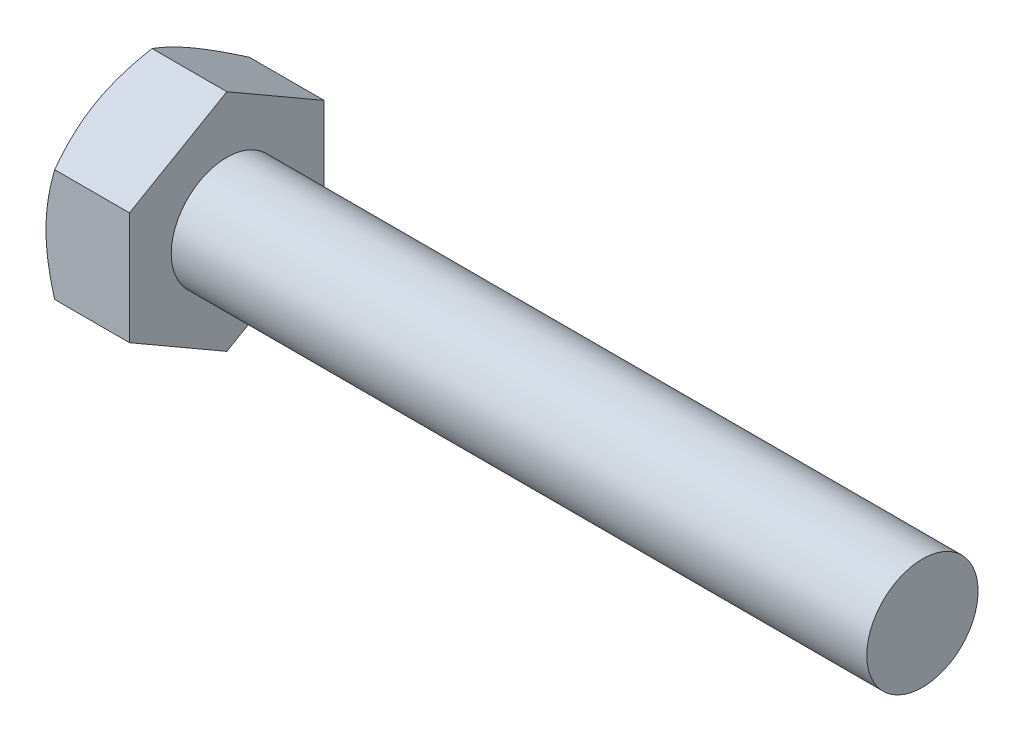
ISO-10303-21;
HEADER;
FILE_DESCRIPTION(('STEP AP214'),'2;1');
FILE_NAME('part.step','',(''),(''),'','','');
FILE_SCHEMA(('AUTOMOTIVE_DESIGN { 1 0 10303 214 1 1 1 1 }'));
ENDSEC;
DATA;
#1=APPLICATION_CONTEXT('core data for automotive mechanical design processes');
#2=APPLICATION_PROTOCOL_DEFINITION('international standard','automotive_design',2000,#1);
#3=PRODUCT_CONTEXT('',#1,'mechanical');
#4=PRODUCT('Part','Part','',(#3));
#5=PRODUCT_RELATED_PRODUCT_CATEGORY('part','',(#4));
#6=PRODUCT_DEFINITION_FORMATION('','',#4);
#7=PRODUCT_DEFINITION_CONTEXT('part definition',#1,'design');
#8=PRODUCT_DEFINITION('design','',#6,#7);
#9=PRODUCT_DEFINITION_SHAPE('','',#8);
#10=(LENGTH_UNIT() NAMED_UNIT(*) SI_UNIT(.MILLI.,.METRE.));
#11=(NAMED_UNIT(*) PLANE_ANGLE_UNIT() SI_UNIT($,.RADIAN.));
#12=(NAMED_UNIT(*) SI_UNIT($,.STERADIAN.) SOLID_ANGLE_UNIT());
#13=UNCERTAINTY_MEASURE_WITH_UNIT(LENGTH_MEASURE(1.E-05),#10,'distance_accuracy_value','');
#14=(GEOMETRIC_REPRESENTATION_CONTEXT(3) GLOBAL_UNCERTAINTY_ASSIGNED_CONTEXT((#13)) GLOBAL_UNIT_ASSIGNED_CONTEXT((#10,
#11,#12)) REPRESENTATION_CONTEXT('',''));
#15=CARTESIAN_POINT('',(0.,0.,0.));
#16=DIRECTION('',(0.,0.,1.));
#17=DIRECTION('',(1.,0.,0.));
#18=AXIS2_PLACEMENT_3D('',#15,#16,#17);
#19=CARTESIAN_POINT('',(0.,0.,0.));
#20=DIRECTION('',(-1.,0.,0.));
#21=DIRECTION('',(0.,0.,1.));
#22=AXIS2_PLACEMENT_3D('',#19,#20,#21);
#23=PLANE('',#22);
#24=CARTESIAN_POINT('',(0.,0.,0.));
#25=DIRECTION('',(-1.,0.,0.));
#26=DIRECTION('',(0.,0.,1.));
#27=AXIS2_PLACEMENT_3D('',#24,#25,#26);
#28=CIRCLE('',#27,3.5);
#29=CARTESIAN_POINT('',(0.,0.,3.5));
#30=VERTEX_POINT('',#29);
#31=CARTESIAN_POINT('',(0.,3.0310889198684,1.75000001147103));
#32=VERTEX_POINT('',#31);
#33=EDGE_CURVE('E39',#30,#32,#28,.T.);
#34=ORIENTED_EDGE('',*,*,#33,.T.);
#35=CARTESIAN_POINT('',(0.,3.0310889198684,-1.75000001147103));
#36=VERTEX_POINT('',#35);
#37=EDGE_CURVE('E195',#32,#36,#28,.T.);
#38=ORIENTED_EDGE('',*,*,#37,.T.);
#39=CARTESIAN_POINT('',(0.,0.,-3.5));
#40=VERTEX_POINT('',#39);
#41=EDGE_CURVE('E200',#36,#40,#28,.T.);
#42=ORIENTED_EDGE('',*,*,#41,.T.);
#43=CARTESIAN_POINT('',(0.,-3.03108891986821,-1.75000001147091));
#44=VERTEX_POINT('',#43);
#45=EDGE_CURVE('E204',#40,#44,#28,.T.);
#46=ORIENTED_EDGE('',*,*,#45,.T.);
#47=CARTESIAN_POINT('',(0.,-3.03108891986821,1.75000001147092));
#48=VERTEX_POINT('',#47);
#49=EDGE_CURVE('E201',#44,#48,#28,.T.);
#50=ORIENTED_EDGE('',*,*,#49,.T.);
#51=EDGE_CURVE('E193',#48,#30,#28,.T.);
#52=ORIENTED_EDGE('',*,*,#51,.T.);
#53=EDGE_LOOP('',(#34,#38,#42,#46,#50,#52));
#54=FACE_BOUND('',#53,.T.);
#55=CARTESIAN_POINT('',(0.,0.,0.));
#56=DIRECTION('',(1.,0.,0.));
#57=DIRECTION('',(0.,0.,-1.));
#58=AXIS2_PLACEMENT_3D('',#55,#56,#57);
#59=CIRCLE('',#58,3.0625);
#60=CARTESIAN_POINT('',(0.,0.,-3.0625));
#61=VERTEX_POINT('',#60);
#62=EDGE_CURVE('E232',#61,#61,#59,.T.);
#63=ORIENTED_EDGE('',*,*,#62,.T.);
#64=EDGE_LOOP('',(#63));
#65=FACE_BOUND('',#64,.T.);
#66=ADVANCED_FACE('F31',(#54,#65),#23,.T.);
#67=CARTESIAN_POINT('',(3.,2.,0.));
#68=DIRECTION('',(-1.,0.,0.));
#69=DIRECTION('',(0.,0.,1.));
#70=AXIS2_PLACEMENT_3D('',#67,#68,#69);
#71=PLANE('',#70);
#72=CARTESIAN_POINT('',(3.,0.,0.));
#73=DIRECTION('',(-1.,0.,0.));
#74=DIRECTION('',(0.,0.,1.));
#75=AXIS2_PLACEMENT_3D('',#72,#73,#74);
#76=CIRCLE('',#75,2.);
#77=CARTESIAN_POINT('',(3.,0.,2.));
#78=VERTEX_POINT('',#77);
#79=EDGE_CURVE('E191',#78,#78,#76,.T.);
#80=ORIENTED_EDGE('',*,*,#79,.T.);
#81=EDGE_LOOP('',(#80));
#82=FACE_BOUND('',#81,.T.);
#83=DIRECTION('',(0.,1.,0.));
#84=VECTOR('',#83,1.);
#85=CARTESIAN_POINT('',(3.,-2.02072595099392,3.5));
#86=LINE('',#85,#84);
#87=CARTESIAN_POINT('',(3.,-2.02072595099392,3.5));
#88=VERTEX_POINT('',#87);
#89=CARTESIAN_POINT('',(3.,2.02072595099418,3.5));
#90=VERTEX_POINT('',#89);
#91=EDGE_CURVE('E54',#88,#90,#86,.T.);
#92=ORIENTED_EDGE('',*,*,#91,.F.);
#93=DIRECTION('',(0.,0.50000000163871,0.866025402838329));
#94=VECTOR('',#93,1.);
#95=CARTESIAN_POINT('',(3.,-4.04145190198797,0.));
#96=LINE('',#95,#94);
#97=CARTESIAN_POINT('',(3.,-4.04145190198797,0.));
#98=VERTEX_POINT('',#97);
#99=EDGE_CURVE('E128',#98,#88,#96,.T.);
#100=ORIENTED_EDGE('',*,*,#99,.F.);
#101=DIRECTION('',(0.,-0.50000000163871,0.866025402838329));
#102=VECTOR('',#101,1.);
#103=CARTESIAN_POINT('',(3.,-2.02072595099392,-3.5));
#104=LINE('',#103,#102);
#105=CARTESIAN_POINT('',(3.,-2.02072595099392,-3.5));
#106=VERTEX_POINT('',#105);
#107=EDGE_CURVE('E126',#106,#98,#104,.T.);
#108=ORIENTED_EDGE('',*,*,#107,.F.);
#109=DIRECTION('',(0.,-1.,0.));
#110=VECTOR('',#109,1.);
#111=CARTESIAN_POINT('',(3.,2.02072595099418,-3.5));
#112=LINE('',#111,#110);
#113=CARTESIAN_POINT('',(3.,2.02072595099418,-3.5));
#114=VERTEX_POINT('',#113);
#115=EDGE_CURVE('E108',#114,#106,#112,.T.);
#116=ORIENTED_EDGE('',*,*,#115,.F.);
#117=DIRECTION('',(0.,-0.50000000163871,-0.866025402838329));
#118=VECTOR('',#117,1.);
#119=CARTESIAN_POINT('',(3.,4.04145190198822,0.));
#120=LINE('',#119,#118);
#121=CARTESIAN_POINT('',(3.,4.04145190198822,0.));
#122=VERTEX_POINT('',#121);
#123=EDGE_CURVE('E117',#122,#114,#120,.T.);
#124=ORIENTED_EDGE('',*,*,#123,.F.);
#125=DIRECTION('',(0.,0.50000000163871,-0.866025402838329));
#126=VECTOR('',#125,1.);
#127=CARTESIAN_POINT('',(3.,2.02072595099418,3.5));
#128=LINE('',#127,#126);
#129=EDGE_CURVE('E121',#90,#122,#128,.T.);
#130=ORIENTED_EDGE('',*,*,#129,.F.);
#131=EDGE_LOOP('',(#92,#100,#108,#116,#124,#130));
#132=FACE_BOUND('',#131,.T.);
#133=ADVANCED_FACE('F123',(#82,#132),#71,.F.);
#134=CARTESIAN_POINT('',(-25.4,0.,0.));
#135=DIRECTION('',(-1.,0.,0.));
#136=DIRECTION('',(0.,0.,1.));
#137=AXIS2_PLACEMENT_3D('',#134,#135,#136);
#138=CYLINDRICAL_SURFACE('',#137,2.);
#139=CARTESIAN_POINT('',(28.,0.,0.));
#140=DIRECTION('',(-1.,0.,0.));
#141=DIRECTION('',(0.,0.,1.));
#142=AXIS2_PLACEMENT_3D('',#139,#140,#141);
#143=CIRCLE('',#142,2.);
#144=CARTESIAN_POINT('',(28.,0.,2.));
#145=VERTEX_POINT('',#144);
#146=EDGE_CURVE('E11',#145,#145,#143,.T.);
#147=ORIENTED_EDGE('',*,*,#146,.T.);
#148=EDGE_LOOP('',(#147));
#149=FACE_BOUND('',#148,.T.);
#150=ORIENTED_EDGE('',*,*,#79,.F.);
#151=EDGE_LOOP('',(#150));
#152=FACE_BOUND('',#151,.T.);
#153=ADVANCED_FACE('F33',(#149,#152),#138,.T.);
#154=CARTESIAN_POINT('',(28.,2.,0.));
#155=DIRECTION('',(1.,0.,0.));
#156=DIRECTION('',(0.,0.,-1.));
#157=AXIS2_PLACEMENT_3D('',#154,#155,#156);
#158=PLANE('',#157);
#159=ORIENTED_EDGE('',*,*,#146,.F.);
#160=EDGE_LOOP('',(#159));
#161=FACE_BOUND('',#160,.T.);
#162=ADVANCED_FACE('F174',(#161),#158,.T.);
#163=CARTESIAN_POINT('',(3.,-2.02072595099392,3.5));
#164=DIRECTION('',(0.,0.,1.));
#165=DIRECTION('',(0.,-1.,0.));
#166=AXIS2_PLACEMENT_3D('',#163,#164,#165);
#167=PLANE('',#166);
#168=DIRECTION('',(-1.,0.,0.));
#169=VECTOR('',#168,1.);
#170=CARTESIAN_POINT('',(3.,-2.02072595099392,3.5));
#171=LINE('',#170,#169);
#172=CARTESIAN_POINT('',(0.312607393718712,-2.02072595099392,3.5));
#173=VERTEX_POINT('',#172);
#174=EDGE_CURVE('E135',#88,#173,#171,.T.);
#175=ORIENTED_EDGE('',*,*,#174,.F.);
#176=ORIENTED_EDGE('',*,*,#91,.T.);
#177=DIRECTION('',(-1.,0.,0.));
#178=VECTOR('',#177,1.);
#179=CARTESIAN_POINT('',(3.,2.02072595099418,3.5));
#180=LINE('',#179,#178);
#181=CARTESIAN_POINT('',(0.312607393718787,2.02072595099418,3.5));
#182=VERTEX_POINT('',#181);
#183=EDGE_CURVE('E134',#90,#182,#180,.T.);
#184=ORIENTED_EDGE('',*,*,#183,.T.);
#185=CARTESIAN_POINT('',(1.67484806169238,-5.35927249297235,3.5));
#186=CARTESIAN_POINT('',(1.60058625481495,-5.20560262685727,3.5));
#187=CARTESIAN_POINT('',(1.52706266884788,-5.05156943551414,3.5));
#188=CARTESIAN_POINT('',(1.38191378342172,-4.7425799526484,3.5));
#189=CARTESIAN_POINT('',(1.31028881262759,-4.58762350691648,3.5));
#190=CARTESIAN_POINT('',(1.1689816800367,-4.27575400803159,3.5));
#191=CARTESIAN_POINT('',(1.09931298164385,-4.11883483254068,3.5));
#192=CARTESIAN_POINT('',(0.96296801053953,-3.80370674725316,3.5));
#193=CARTESIAN_POINT('',(0.896291581847454,-3.64549790519329,3.5));
#194=CARTESIAN_POINT('',(0.765935238903121,-3.3255747785794,3.5));
#195=CARTESIAN_POINT('',(0.702302163466714,-3.16384130375996,3.5));
#196=CARTESIAN_POINT('',(0.580019718262901,-2.83846669718326,3.5));
#197=CARTESIAN_POINT('',(0.521370902967191,-2.67482535548292,3.5));
#198=CARTESIAN_POINT('',(0.410632848690435,-2.34571076899079,3.5));
#199=CARTESIAN_POINT('',(0.358529664161106,-2.18024226493578,3.5));
#200=CARTESIAN_POINT('',(0.262575007941632,-1.84695290496081,3.5));
#201=CARTESIAN_POINT('',(0.218720926775726,-1.67913281104083,3.5));
#202=CARTESIAN_POINT('',(0.141393469502878,-1.34102565373071,3.5));
#203=CARTESIAN_POINT('',(0.107922856886721,-1.17073794620201,3.5));
#204=CARTESIAN_POINT('',(0.0536158942970015,-0.828109435792751,3.5));
#205=CARTESIAN_POINT('',(0.032779555483253,-0.655768631098832,3.5));
#206=CARTESIAN_POINT('',(0.00558442789894163,-0.311027197192032,3.5));
#207=CARTESIAN_POINT('',(-0.000866016136343608,-0.138633986421078,3.5));
#208=CARTESIAN_POINT('',(0.00105333917596495,0.206031735450673,3.5));
#209=CARTESIAN_POINT('',(0.00941929143857086,0.378304266267543,3.5));
#210=CARTESIAN_POINT('',(0.0357682117584208,0.672484276575518,3.5));
#211=CARTESIAN_POINT('',(0.0503198071855807,0.794716305899973,3.5));
#212=CARTESIAN_POINT('',(0.0859356049318978,1.03823616523099,3.5));
#213=CARTESIAN_POINT('',(0.107000834350724,1.15952384323355,3.5));
#214=CARTESIAN_POINT('',(0.178861425196795,1.52187147554632,3.5));
#215=CARTESIAN_POINT('',(0.238303187271366,1.76123299291093,3.5));
#216=CARTESIAN_POINT('',(0.340824243733489,2.11940111894071,3.5));
#217=CARTESIAN_POINT('',(0.377746969617674,2.24007467470749,3.5));
#218=CARTESIAN_POINT('',(0.455245965098372,2.4801622786992,3.5));
#219=CARTESIAN_POINT('',(0.495819714732194,2.59957713305198,3.5));
#220=CARTESIAN_POINT('',(0.579776487259233,2.83664797958397,3.5));
#221=CARTESIAN_POINT('',(0.623142412255378,2.95431008852161,3.5));
#222=CARTESIAN_POINT('',(0.712419619642632,3.1887214040014,3.5));
#223=CARTESIAN_POINT('',(0.758331930772586,3.30547021951698,3.5));
#224=CARTESIAN_POINT('',(0.805266155187939,3.42179689678997,3.5));
#225=B_SPLINE_CURVE_WITH_KNOTS('',3,(#185,#186,#187,#188,#189,#190,#191,#192,#193,#194,#195,
#196,#197,#198,#199,#200,#201,#202,#203,#204,#205,#206,#207,#208,#209,#210,#211,#212,#213,#214,
#215,#216,#217,#218,#219,#220,#221,#222,#223,#224),.UNSPECIFIED.,.F.,.F.,(4,2,2,2,2,2,2,2,2,2,2,
2,2,2,2,2,2,2,2,4),(0.,0.512025616450344,1.02413929719673,1.53918358111938,2.05420098562825,
2.57554135011061,3.09693963514844,3.617207524619,4.13731055762517,4.65755189406135,
5.17779369002434,5.69471134183552,6.21149479538709,6.58060002841468,6.94976349335369,
7.68863984553131,8.06719737533765,8.44549559730556,8.82166450684655,9.19798651142491),.UNSPECIFIED.);
#226=EDGE_CURVE('E176',#30,#182,#225,.T.);
#227=ORIENTED_EDGE('',*,*,#226,.F.);
#228=EDGE_CURVE('E183',#173,#30,#225,.T.);
#229=ORIENTED_EDGE('',*,*,#228,.F.);
#230=EDGE_LOOP('',(#175,#176,#184,#227,#229));
#231=FACE_BOUND('',#230,.T.);
#232=ADVANCED_FACE('F170',(#231),#167,.T.);
#233=CARTESIAN_POINT('',(3.,-4.04145190198797,0.));
#234=DIRECTION('',(0.,-0.866025402838329,0.50000000163871));
#235=DIRECTION('',(0.,-0.50000000163871,-0.866025402838329));
#236=AXIS2_PLACEMENT_3D('',#233,#234,#235);
#237=PLANE('',#236);
#238=DIRECTION('',(-1.,0.,0.));
#239=VECTOR('',#238,1.);
#240=CARTESIAN_POINT('',(3.,-4.04145190198797,0.));
#241=LINE('',#240,#239);
#242=CARTESIAN_POINT('',(0.312607401365989,-4.04145190198797,0.));
#243=VERTEX_POINT('',#242);
#244=EDGE_CURVE('E139',#98,#243,#241,.T.);
#245=ORIENTED_EDGE('',*,*,#244,.F.);
#246=ORIENTED_EDGE('',*,*,#99,.T.);
#247=ORIENTED_EDGE('',*,*,#174,.T.);
#248=CARTESIAN_POINT('',(0.312674070890008,-4.04156737204231,-0.000199999999998893));
#249=CARTESIAN_POINT('',(0.261385798811625,-3.95276675550721,0.153607178910108));
#250=CARTESIAN_POINT('',(0.214740963264632,-3.86319961761306,0.308742011753377));
#251=CARTESIAN_POINT('',(0.133321884256453,-3.6825143878944,0.621698008435777));
#252=CARTESIAN_POINT('',(0.0985764439558505,-3.59139308551138,0.779524733125321));
#253=CARTESIAN_POINT('',(0.044490034901749,-3.41027975987651,1.09322221368186));
#254=CARTESIAN_POINT('',(0.0247890936776269,-3.32031560336033,1.24904470294703));
#255=CARTESIAN_POINT('',(0.00127013962083129,-3.13996397104522,1.56142289197973));
#256=CARTESIAN_POINT('',(-0.00256734880304287,-3.04957715079016,1.71797745631196));
#257=CARTESIAN_POINT('',(0.00541530815472377,-2.88068385453759,2.01050922520086));
#258=CARTESIAN_POINT('',(0.0152754401087311,-2.80215209782702,2.14653021723682));
#259=CARTESIAN_POINT('',(0.0465264723843618,-2.64560021906557,2.41768602408708));
#260=CARTESIAN_POINT('',(0.0679280484549583,-2.56758063851062,2.55281990100294));
#261=CARTESIAN_POINT('',(0.121430412361872,-2.41070597077444,2.82453479475513));
#262=CARTESIAN_POINT('',(0.153757998551572,-2.33187073892935,2.96108142114061));
#263=CARTESIAN_POINT('',(0.227128937144306,-2.1753760952862,3.23213809385844));
#264=CARTESIAN_POINT('',(0.268155049511203,-2.09771467850601,3.3666516129217));
#265=CARTESIAN_POINT('',(0.312674063242076,-2.02061048093958,3.5002));
#266=B_SPLINE_CURVE_WITH_KNOTS('',3,(#248,#249,#250,#251,#252,#253,#254,#255,#256,#257,#258,
#259,#260,#261,#262,#263,#264,#265),.UNSPECIFIED.,.F.,.F.,(4,2,2,2,2,2,2,2,4),(0.,
0.554793835282341,1.11092124295949,1.65328467799349,2.19498205429069,2.66665131675847,
3.13875761996707,3.62133613161606,4.10296699145097),.UNSPECIFIED.);
#267=EDGE_CURVE('E185',#48,#173,#266,.T.);
#268=ORIENTED_EDGE('',*,*,#267,.F.);
#269=EDGE_CURVE('E184',#243,#48,#266,.T.);
#270=ORIENTED_EDGE('',*,*,#269,.F.);
#271=EDGE_LOOP('',(#245,#246,#247,#268,#270));
#272=FACE_BOUND('',#271,.T.);
#273=ADVANCED_FACE('F173',(#272),#237,.T.);
#274=CARTESIAN_POINT('',(3.,-2.02072595099392,-3.5));
#275=DIRECTION('',(0.,-0.866025402838329,-0.50000000163871));
#276=DIRECTION('',(0.,0.50000000163871,-0.866025402838329));
#277=AXIS2_PLACEMENT_3D('',#274,#275,#276);
#278=PLANE('',#277);
#279=DIRECTION('',(-1.,0.,0.));
#280=VECTOR('',#279,1.);
#281=CARTESIAN_POINT('',(3.,-2.02072595099392,-3.5));
#282=LINE('',#281,#280);
#283=CARTESIAN_POINT('',(0.312607393718712,-2.02072595099392,-3.5));
#284=VERTEX_POINT('',#283);
#285=EDGE_CURVE('E114',#106,#284,#282,.T.);
#286=ORIENTED_EDGE('',*,*,#285,.F.);
#287=ORIENTED_EDGE('',*,*,#107,.T.);
#288=ORIENTED_EDGE('',*,*,#244,.T.);
#289=CARTESIAN_POINT('',(0.312674063242075,-2.02061048093958,-3.5002));
#290=CARTESIAN_POINT('',(0.26138579178689,-2.10941109725974,-3.34639282146217));
#291=CARTESIAN_POINT('',(0.214740956902972,-2.19897823493762,-3.19125798899348));
#292=CARTESIAN_POINT('',(0.133321879273378,-2.37966346420301,-2.87830199309618));
#293=CARTESIAN_POINT('',(0.0985764396875665,-2.47078476634889,-2.72047526881738));
#294=CARTESIAN_POINT('',(0.0444900320559981,-2.65189809150058,-2.40677778909772));
#295=CARTESIAN_POINT('',(0.0247890915409131,-2.74186224777148,-2.25095530025738));
#296=CARTESIAN_POINT('',(0.00127013885118929,-2.92221387956705,-1.93857711212457));
#297=CARTESIAN_POINT('',(-0.00256734891421731,-3.01260069954789,-1.78202254826729));
#298=CARTESIAN_POINT('',(0.00541530918970343,-3.18149399578971,-1.48949077939701));
#299=CARTESIAN_POINT('',(0.0152754417280289,-3.26002575276585,-1.35346978690109));
#300=CARTESIAN_POINT('',(0.0465264752019282,-3.41657763203708,-1.08231397916784));
#301=CARTESIAN_POINT('',(0.0679280518865975,-3.49459721283624,-0.947180101829));
#302=CARTESIAN_POINT('',(0.121430417027312,-3.65147188105587,-0.675465207239443));
#303=CARTESIAN_POINT('',(0.153758003837374,-3.73030711313977,-0.538918580440348));
#304=CARTESIAN_POINT('',(0.227128943639436,-3.88680175724689,-0.26786190691889));
#305=CARTESIAN_POINT('',(0.268155056595055,-3.96446317425231,-0.133348387465519));
#306=CARTESIAN_POINT('',(0.312674070890007,-4.04156737204231,0.000200000000001392));
#307=B_SPLINE_CURVE_WITH_KNOTS('',3,(#289,#290,#291,#292,#293,#294,#295,#296,#297,#298,#299,
#300,#301,#302,#303,#304,#305,#306),.UNSPECIFIED.,.F.,.F.,(4,2,2,2,2,2,2,2,4),(0.,
0.554793833522011,1.11092123939605,1.6532846727349,2.19498204735176,2.66665131151668,
3.1387576164279,3.6213361298565,4.10296699145095),.UNSPECIFIED.);
#308=EDGE_CURVE('E214',#44,#243,#307,.T.);
#309=ORIENTED_EDGE('',*,*,#308,.F.);
#310=EDGE_CURVE('E219',#284,#44,#307,.T.);
#311=ORIENTED_EDGE('',*,*,#310,.F.);
#312=EDGE_LOOP('',(#286,#287,#288,#309,#311));
#313=FACE_BOUND('',#312,.T.);
#314=ADVANCED_FACE('F291',(#313),#278,.T.);
#315=CARTESIAN_POINT('',(3.,2.02072595099418,-3.5));
#316=DIRECTION('',(0.,0.,-1.));
#317=DIRECTION('',(-1.,0.,0.));
#318=AXIS2_PLACEMENT_3D('',#315,#316,#317);
#319=PLANE('',#318);
#320=DIRECTION('',(-1.,0.,0.));
#321=VECTOR('',#320,1.);
#322=CARTESIAN_POINT('',(3.,2.02072595099418,-3.5));
#323=LINE('',#322,#321);
#324=CARTESIAN_POINT('',(0.312607393718785,2.02072595099418,-3.5));
#325=VERTEX_POINT('',#324);
#326=EDGE_CURVE('E103',#114,#325,#323,.T.);
#327=ORIENTED_EDGE('',*,*,#326,.F.);
#328=ORIENTED_EDGE('',*,*,#115,.T.);
#329=ORIENTED_EDGE('',*,*,#285,.T.);
#330=CARTESIAN_POINT('',(1.67484806169238,-5.35927249297235,-3.5));
#331=CARTESIAN_POINT('',(1.60058625481495,-5.20560262685727,-3.5));
#332=CARTESIAN_POINT('',(1.52706266884788,-5.05156943551414,-3.5));
#333=CARTESIAN_POINT('',(1.38191378342172,-4.7425799526484,-3.5));
#334=CARTESIAN_POINT('',(1.31028881262759,-4.58762350691648,-3.5));
#335=CARTESIAN_POINT('',(1.1689816800367,-4.27575400803159,-3.5));
#336=CARTESIAN_POINT('',(1.09931298164385,-4.11883483254068,-3.5));
#337=CARTESIAN_POINT('',(0.962968010539531,-3.80370674725316,-3.5));
#338=CARTESIAN_POINT('',(0.896291581847455,-3.64549790519329,-3.5));
#339=CARTESIAN_POINT('',(0.765935238903122,-3.32557477857941,-3.5));
#340=CARTESIAN_POINT('',(0.702302163466714,-3.16384130375996,-3.5));
#341=CARTESIAN_POINT('',(0.580019718262902,-2.83846669718326,-3.5));
#342=CARTESIAN_POINT('',(0.521370902967191,-2.67482535548292,-3.5));
#343=CARTESIAN_POINT('',(0.410632848690435,-2.34571076899079,-3.5));
#344=CARTESIAN_POINT('',(0.358529664161106,-2.18024226493578,-3.5));
#345=CARTESIAN_POINT('',(0.262575007941632,-1.84695290496081,-3.5));
#346=CARTESIAN_POINT('',(0.218720926775726,-1.67913281104083,-3.5));
#347=CARTESIAN_POINT('',(0.141393469502878,-1.34102565373071,-3.5));
#348=CARTESIAN_POINT('',(0.107922856886721,-1.17073794620201,-3.5));
#349=CARTESIAN_POINT('',(0.053615894297001,-0.828109435792751,-3.5));
#350=CARTESIAN_POINT('',(0.0327795554832525,-0.655768631098832,-3.5));
#351=CARTESIAN_POINT('',(0.00558442789894099,-0.311027197192032,-3.5));
#352=CARTESIAN_POINT('',(-0.000866016136344294,-0.138633986421078,-3.5));
#353=CARTESIAN_POINT('',(0.00105333917596411,0.206031735450673,-3.5));
#354=CARTESIAN_POINT('',(0.00941929143856992,0.378304266267543,-3.5));
#355=CARTESIAN_POINT('',(0.0357682117584198,0.672484276575518,-3.5));
#356=CARTESIAN_POINT('',(0.0503198071855797,0.794716305899972,-3.5));
#357=CARTESIAN_POINT('',(0.0859356049318966,1.03823616523099,-3.5));
#358=CARTESIAN_POINT('',(0.107000834350723,1.15952384323355,-3.5));
#359=CARTESIAN_POINT('',(0.178861425196793,1.52187147554632,-3.5));
#360=CARTESIAN_POINT('',(0.238303187271364,1.76123299291093,-3.5));
#361=CARTESIAN_POINT('',(0.340824243733486,2.11940111894071,-3.5));
#362=CARTESIAN_POINT('',(0.377746969617671,2.24007467470749,-3.5));
#363=CARTESIAN_POINT('',(0.455245965098368,2.48016227869919,-3.5));
#364=CARTESIAN_POINT('',(0.495819714732191,2.59957713305197,-3.5));
#365=CARTESIAN_POINT('',(0.57977648725923,2.83664797958397,-3.5));
#366=CARTESIAN_POINT('',(0.623142412255375,2.9543100885216,-3.5));
#367=CARTESIAN_POINT('',(0.712419619642629,3.18872140400139,-3.5));
#368=CARTESIAN_POINT('',(0.758331930772583,3.30547021951698,-3.5));
#369=CARTESIAN_POINT('',(0.805266155187936,3.42179689678997,-3.5));
#370=B_SPLINE_CURVE_WITH_KNOTS('',3,(#330,#331,#332,#333,#334,#335,#336,#337,#338,#339,#340,
#341,#342,#343,#344,#345,#346,#347,#348,#349,#350,#351,#352,#353,#354,#355,#356,#357,#358,#359,
#360,#361,#362,#363,#364,#365,#366,#367,#368,#369),.UNSPECIFIED.,.F.,.F.,(4,2,2,2,2,2,2,2,2,2,2,
2,2,2,2,2,2,2,2,4),(0.,0.512025616450344,1.02413929719673,1.53918358111938,2.05420098562824,
2.57554135011061,3.09693963514844,3.617207524619,4.13731055762518,4.65755189406135,
5.17779369002434,5.69471134183552,6.21149479538709,6.58060002841468,6.94976349335369,
7.68863984553131,8.06719737533764,8.44549559730556,8.82166450684655,9.19798651142491),.UNSPECIFIED.);
#371=EDGE_CURVE('E215',#40,#284,#370,.F.);
#372=ORIENTED_EDGE('',*,*,#371,.F.);
#373=EDGE_CURVE('E111',#325,#40,#370,.F.);
#374=ORIENTED_EDGE('',*,*,#373,.F.);
#375=EDGE_LOOP('',(#327,#328,#329,#372,#374));
#376=FACE_BOUND('',#375,.T.);
#377=ADVANCED_FACE('F105',(#376),#319,.T.);
#378=CARTESIAN_POINT('',(3.,4.04145190198822,0.));
#379=DIRECTION('',(0.,0.866025402838329,-0.50000000163871));
#380=DIRECTION('',(0.,0.50000000163871,0.866025402838329));
#381=AXIS2_PLACEMENT_3D('',#378,#379,#380);
#382=PLANE('',#381);
#383=DIRECTION('',(-1.,0.,0.));
#384=VECTOR('',#383,1.);
#385=CARTESIAN_POINT('',(3.,4.04145190198822,0.));
#386=LINE('',#385,#384);
#387=CARTESIAN_POINT('',(0.312607401366136,4.04145190198822,0.));
#388=VERTEX_POINT('',#387);
#389=EDGE_CURVE('E46',#122,#388,#386,.T.);
#390=ORIENTED_EDGE('',*,*,#389,.F.);
#391=ORIENTED_EDGE('',*,*,#123,.T.);
#392=ORIENTED_EDGE('',*,*,#326,.T.);
#393=CARTESIAN_POINT('',(0.312674070890156,4.04156737204256,0.000200000000001487));
#394=CARTESIAN_POINT('',(0.261385798811769,3.95276675550746,-0.153607178910115));
#395=CARTESIAN_POINT('',(0.214740963264773,3.86319961761331,-0.308742011753393));
#396=CARTESIAN_POINT('',(0.13332188425659,3.68251438789463,-0.621698008435814));
#397=CARTESIAN_POINT('',(0.0985764439559847,3.59139308551161,-0.779524733125367));
#398=CARTESIAN_POINT('',(0.0444900349018798,3.41027975987673,-1.09322221368193));
#399=CARTESIAN_POINT('',(0.0247890936777563,3.32031560336054,-1.24904470294711));
#400=CARTESIAN_POINT('',(0.00127013962095893,3.13996397104542,-1.56142289197982));
#401=CARTESIAN_POINT('',(-0.00256734880291563,3.04957715079036,-1.71797745631206));
#402=CARTESIAN_POINT('',(0.00541530815485089,2.88068385453778,-2.01050922520097));
#403=CARTESIAN_POINT('',(0.0152754401088568,2.80215209782721,-2.14653021723692));
#404=CARTESIAN_POINT('',(0.046526472384482,2.64560021906578,-2.41768602408716));
#405=CARTESIAN_POINT('',(0.0679280484550747,2.56758063851084,-2.55281990100301));
#406=CARTESIAN_POINT('',(0.121430412361979,2.41070597077467,-2.82453479475518));
#407=CARTESIAN_POINT('',(0.153757998551674,2.33187073892958,-2.96108142114065));
#408=CARTESIAN_POINT('',(0.227128937144394,2.17537609528645,-3.23213809385846));
#409=CARTESIAN_POINT('',(0.268155049511284,2.09771467850626,-3.3666516129217));
#410=CARTESIAN_POINT('',(0.312674063242149,2.02061048093983,-3.5002));
#411=B_SPLINE_CURVE_WITH_KNOTS('',3,(#393,#394,#395,#396,#397,#398,#399,#400,#401,#402,#403,
#404,#405,#406,#407,#408,#409,#410),.UNSPECIFIED.,.F.,.F.,(4,2,2,2,2,2,2,2,4),(0.,
0.554793835282376,1.11092124295956,1.65328467799359,2.19498205429083,2.66665131675857,
3.13875761996714,3.62133613161609,4.10296699145097),.UNSPECIFIED.);
#412=EDGE_CURVE('E153',#36,#325,#411,.T.);
#413=ORIENTED_EDGE('',*,*,#412,.F.);
#414=EDGE_CURVE('E378',#388,#36,#411,.T.);
#415=ORIENTED_EDGE('',*,*,#414,.F.);
#416=EDGE_LOOP('',(#390,#391,#392,#413,#415));
#417=FACE_BOUND('',#416,.T.);
#418=ADVANCED_FACE('F118',(#417),#382,.T.);
#419=CARTESIAN_POINT('',(3.,2.02072595099418,3.5));
#420=DIRECTION('',(0.,0.866025402838329,0.50000000163871));
#421=DIRECTION('',(0.,-0.50000000163871,0.866025402838329));
#422=AXIS2_PLACEMENT_3D('',#419,#420,#421);
#423=PLANE('',#422);
#424=ORIENTED_EDGE('',*,*,#183,.F.);
#425=ORIENTED_EDGE('',*,*,#129,.T.);
#426=ORIENTED_EDGE('',*,*,#389,.T.);
#427=CARTESIAN_POINT('',(0.312674063242151,2.02061048093983,3.5002));
#428=CARTESIAN_POINT('',(0.261385791786968,2.10941109726,3.34639282146217));
#429=CARTESIAN_POINT('',(0.214740956903054,2.19897823493788,3.19125798899347));
#430=CARTESIAN_POINT('',(0.133321879273468,2.37966346420328,2.87830199309616));
#431=CARTESIAN_POINT('',(0.0985764396876609,2.47078476634916,2.72047526881735));
#432=CARTESIAN_POINT('',(0.0444900320561025,2.65189809150087,2.40677778909768));
#433=CARTESIAN_POINT('',(0.0247890915410229,2.74186224777177,2.25095530025734));
#434=CARTESIAN_POINT('',(0.00127013885131089,2.92221387956734,1.93857711212451));
#435=CARTESIAN_POINT('',(-0.00256734891408949,3.01260069954819,1.78202254826723));
#436=CARTESIAN_POINT('',(0.00541530918984211,3.18149399579,1.48949077939695));
#437=CARTESIAN_POINT('',(0.0152754417281714,3.26002575276614,1.35346978690103));
#438=CARTESIAN_POINT('',(0.0465264752020767,3.41657763203737,1.08231397916779));
#439=CARTESIAN_POINT('',(0.0679280518867481,3.49459721283652,0.947180101828961));
#440=CARTESIAN_POINT('',(0.121430417027465,3.65147188105615,0.675465207239415));
#441=CARTESIAN_POINT('',(0.153758003837527,3.73030711314004,0.538918580440327));
#442=CARTESIAN_POINT('',(0.227128943639588,3.88680175724716,0.267861906918881));
#443=CARTESIAN_POINT('',(0.268155056595205,3.96446317425257,0.133348387465516));
#444=CARTESIAN_POINT('',(0.312674070890156,4.04156737204256,-0.000199999999999121));
#445=B_SPLINE_CURVE_WITH_KNOTS('',3,(#427,#428,#429,#430,#431,#432,#433,#434,#435,#436,#437,
#438,#439,#440,#441,#442,#443,#444),.UNSPECIFIED.,.F.,.F.,(4,2,2,2,2,2,2,2,4),(0.,
0.554793833522028,1.11092123939609,1.65328467273496,2.19498204735184,2.66665131151673,
3.13875761642794,3.62133612985651,4.10296699145095),.UNSPECIFIED.);
#446=EDGE_CURVE('E138',#32,#388,#445,.T.);
#447=ORIENTED_EDGE('',*,*,#446,.F.);
#448=EDGE_CURVE('E152',#182,#32,#445,.T.);
#449=ORIENTED_EDGE('',*,*,#448,.F.);
#450=EDGE_LOOP('',(#424,#425,#426,#447,#449));
#451=FACE_BOUND('',#450,.T.);
#452=ADVANCED_FACE('F163',(#451),#423,.T.);
#453=CARTESIAN_POINT('',(0.,0.,0.));
#454=DIRECTION('',(1.,0.,0.));
#455=DIRECTION('',(0.,0.,-1.));
#456=AXIS2_PLACEMENT_3D('',#453,#454,#455);
#457=CONICAL_SURFACE('',#456,3.5,1.0471975511966);
#458=ORIENTED_EDGE('',*,*,#51,.F.);
#459=ORIENTED_EDGE('',*,*,#267,.T.);
#460=ORIENTED_EDGE('',*,*,#228,.T.);
#461=EDGE_LOOP('',(#458,#459,#460));
#462=FACE_BOUND('',#461,.T.);
#463=ADVANCED_FACE('F167',(#462),#457,.T.);
#464=ORIENTED_EDGE('',*,*,#49,.F.);
#465=ORIENTED_EDGE('',*,*,#308,.T.);
#466=ORIENTED_EDGE('',*,*,#269,.T.);
#467=EDGE_LOOP('',(#464,#465,#466));
#468=FACE_BOUND('',#467,.T.);
#469=ADVANCED_FACE('F224',(#468),#457,.T.);
#470=ORIENTED_EDGE('',*,*,#371,.T.);
#471=ORIENTED_EDGE('',*,*,#310,.T.);
#472=ORIENTED_EDGE('',*,*,#45,.F.);
#473=EDGE_LOOP('',(#470,#471,#472));
#474=FACE_BOUND('',#473,.T.);
#475=ADVANCED_FACE('F159',(#474),#457,.T.);
#476=ORIENTED_EDGE('',*,*,#412,.T.);
#477=ORIENTED_EDGE('',*,*,#373,.T.);
#478=ORIENTED_EDGE('',*,*,#41,.F.);
#479=EDGE_LOOP('',(#476,#477,#478));
#480=FACE_BOUND('',#479,.T.);
#481=ADVANCED_FACE('F213',(#480),#457,.T.);
#482=ORIENTED_EDGE('',*,*,#33,.F.);
#483=ORIENTED_EDGE('',*,*,#226,.T.);
#484=ORIENTED_EDGE('',*,*,#448,.T.);
#485=EDGE_LOOP('',(#482,#483,#484));
#486=FACE_BOUND('',#485,.T.);
#487=ADVANCED_FACE('F250',(#486),#457,.T.);
#488=ORIENTED_EDGE('',*,*,#446,.T.);
#489=ORIENTED_EDGE('',*,*,#414,.T.);
#490=ORIENTED_EDGE('',*,*,#37,.F.);
#491=EDGE_LOOP('',(#488,#489,#490));
#492=FACE_BOUND('',#491,.T.);
#493=ADVANCED_FACE('F241',(#492),#457,.T.);
#494=CARTESIAN_POINT('',(0.375,0.,0.));
#495=DIRECTION('',(-1.,0.,0.));
#496=DIRECTION('',(0.,0.,1.));
#497=AXIS2_PLACEMENT_3D('',#494,#495,#496);
#498=CYLINDRICAL_SURFACE('',#497,3.0625);
#499=CARTESIAN_POINT('',(0.375,0.,0.));
#500=DIRECTION('',(1.,0.,0.));
#501=DIRECTION('',(0.,0.,-1.));
#502=AXIS2_PLACEMENT_3D('',#499,#500,#501);
#503=CIRCLE('',#502,3.0625);
#504=CARTESIAN_POINT('',(0.375,0.,-3.0625));
#505=VERTEX_POINT('',#504);
#506=EDGE_CURVE('E229',#505,#505,#503,.T.);
#507=ORIENTED_EDGE('',*,*,#506,.T.);
#508=EDGE_LOOP('',(#507));
#509=FACE_BOUND('',#508,.T.);
#510=ORIENTED_EDGE('',*,*,#62,.F.);
#511=EDGE_LOOP('',(#510));
#512=FACE_BOUND('',#511,.T.);
#513=ADVANCED_FACE('F238',(#509,#512),#498,.F.);
#514=CARTESIAN_POINT('',(0.375,0.,0.));
#515=DIRECTION('',(1.,0.,0.));
#516=DIRECTION('',(0.,0.,-1.));
#517=AXIS2_PLACEMENT_3D('',#514,#515,#516);
#518=PLANE('',#517);
#519=ORIENTED_EDGE('',*,*,#506,.F.);
#520=EDGE_LOOP('',(#519));
#521=FACE_BOUND('',#520,.T.);
#522=ADVANCED_FACE('F240',(#521),#518,.F.);
#523=CLOSED_SHELL('',(#66,#133,#153,#162,#232,#273,#314,#377,#418,#452,#463,#469,#475,#481,#487,
#493,#513,#522));
#524=MANIFOLD_SOLID_BREP('B2',#523);
#525=ADVANCED_BREP_SHAPE_REPRESENTATION('',(#18,#524),#14);
#526=SHAPE_DEFINITION_REPRESENTATION(#9,#525);
ENDSEC;
END-ISO-10303-21;
